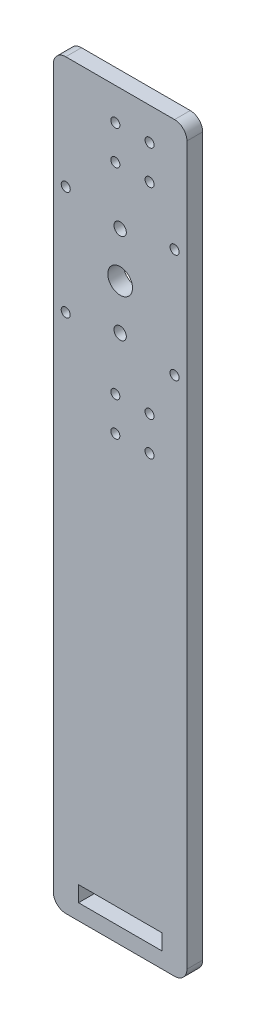
ISO-10303-21;
HEADER;
FILE_DESCRIPTION(('STEP AP214'),'2;1');
FILE_NAME('part.step','',(''),(''),'','','');
FILE_SCHEMA(('AUTOMOTIVE_DESIGN { 1 0 10303 214 1 1 1 1 }'));
ENDSEC;
DATA;
#1=APPLICATION_CONTEXT('core data for automotive mechanical design processes');
#2=APPLICATION_PROTOCOL_DEFINITION('international standard','automotive_design',2000,#1);
#3=PRODUCT_CONTEXT('',#1,'mechanical');
#4=PRODUCT('Part','Part','',(#3));
#5=PRODUCT_RELATED_PRODUCT_CATEGORY('part','',(#4));
#6=PRODUCT_DEFINITION_FORMATION('','',#4);
#7=PRODUCT_DEFINITION_CONTEXT('part definition',#1,'design');
#8=PRODUCT_DEFINITION('design','',#6,#7);
#9=PRODUCT_DEFINITION_SHAPE('','',#8);
#10=(LENGTH_UNIT() NAMED_UNIT(*) SI_UNIT(.MILLI.,.METRE.));
#11=(NAMED_UNIT(*) PLANE_ANGLE_UNIT() SI_UNIT($,.RADIAN.));
#12=(NAMED_UNIT(*) SI_UNIT($,.STERADIAN.) SOLID_ANGLE_UNIT());
#13=UNCERTAINTY_MEASURE_WITH_UNIT(LENGTH_MEASURE(1.E-05),#10,'distance_accuracy_value','');
#14=(GEOMETRIC_REPRESENTATION_CONTEXT(3) GLOBAL_UNCERTAINTY_ASSIGNED_CONTEXT((#13)) GLOBAL_UNIT_ASSIGNED_CONTEXT((#10,
#11,#12)) REPRESENTATION_CONTEXT('',''));
#15=CARTESIAN_POINT('',(0.,0.,0.));
#16=DIRECTION('',(0.,0.,1.));
#17=DIRECTION('',(1.,0.,0.));
#18=AXIS2_PLACEMENT_3D('',#15,#16,#17);
#19=CARTESIAN_POINT('',(-27.,-150.,6.35));
#20=DIRECTION('',(0.,1.,0.));
#21=DIRECTION('',(0.,0.,1.));
#22=AXIS2_PLACEMENT_3D('',#19,#20,#21);
#23=PLANE('',#22);
#24=DIRECTION('',(1.,0.,0.));
#25=VECTOR('',#24,1.);
#26=CARTESIAN_POINT('',(-27.,-150.,0.));
#27=LINE('',#26,#25);
#28=CARTESIAN_POINT('',(-22.,-150.,0.));
#29=VERTEX_POINT('',#28);
#30=CARTESIAN_POINT('',(22.,-150.,0.));
#31=VERTEX_POINT('',#30);
#32=EDGE_CURVE('E236',#29,#31,#27,.T.);
#33=ORIENTED_EDGE('',*,*,#32,.T.);
#34=DIRECTION('',(0.,0.,-1.));
#35=VECTOR('',#34,1.);
#36=CARTESIAN_POINT('',(22.,-150.,6.35));
#37=LINE('',#36,#35);
#38=CARTESIAN_POINT('',(22.,-150.,6.35));
#39=VERTEX_POINT('',#38);
#40=EDGE_CURVE('E278',#31,#39,#37,.F.);
#41=ORIENTED_EDGE('',*,*,#40,.T.);
#42=DIRECTION('',(1.,0.,0.));
#43=VECTOR('',#42,1.);
#44=CARTESIAN_POINT('',(-27.,-150.,6.35));
#45=LINE('',#44,#43);
#46=CARTESIAN_POINT('',(-22.,-150.,6.35));
#47=VERTEX_POINT('',#46);
#48=EDGE_CURVE('E239',#47,#39,#45,.T.);
#49=ORIENTED_EDGE('',*,*,#48,.F.);
#50=DIRECTION('',(0.,0.,-1.));
#51=VECTOR('',#50,1.);
#52=CARTESIAN_POINT('',(-22.,-150.,6.35));
#53=LINE('',#52,#51);
#54=EDGE_CURVE('E275',#47,#29,#53,.T.);
#55=ORIENTED_EDGE('',*,*,#54,.T.);
#56=EDGE_LOOP('',(#33,#41,#49,#55));
#57=FACE_BOUND('',#56,.T.);
#58=ADVANCED_FACE('F32',(#57),#23,.F.);
#59=CARTESIAN_POINT('',(27.,-150.,6.35));
#60=DIRECTION('',(-1.,0.,0.));
#61=DIRECTION('',(0.,0.,1.));
#62=AXIS2_PLACEMENT_3D('',#59,#60,#61);
#63=PLANE('',#62);
#64=DIRECTION('',(0.,1.,0.));
#65=VECTOR('',#64,1.);
#66=CARTESIAN_POINT('',(27.,-150.,6.35));
#67=LINE('',#66,#65);
#68=CARTESIAN_POINT('',(27.,-145.,6.35));
#69=VERTEX_POINT('',#68);
#70=CARTESIAN_POINT('',(27.,145.,6.35));
#71=VERTEX_POINT('',#70);
#72=EDGE_CURVE('E242',#69,#71,#67,.T.);
#73=ORIENTED_EDGE('',*,*,#72,.F.);
#74=DIRECTION('',(0.,0.,-1.));
#75=VECTOR('',#74,1.);
#76=CARTESIAN_POINT('',(27.,-145.,6.35));
#77=LINE('',#76,#75);
#78=CARTESIAN_POINT('',(27.,-145.,0.));
#79=VERTEX_POINT('',#78);
#80=EDGE_CURVE('E264',#69,#79,#77,.T.);
#81=ORIENTED_EDGE('',*,*,#80,.T.);
#82=DIRECTION('',(0.,1.,0.));
#83=VECTOR('',#82,1.);
#84=CARTESIAN_POINT('',(27.,-150.,0.));
#85=LINE('',#84,#83);
#86=CARTESIAN_POINT('',(27.,145.,0.));
#87=VERTEX_POINT('',#86);
#88=EDGE_CURVE('E255',#79,#87,#85,.T.);
#89=ORIENTED_EDGE('',*,*,#88,.T.);
#90=DIRECTION('',(0.,0.,-1.));
#91=VECTOR('',#90,1.);
#92=CARTESIAN_POINT('',(27.,145.,6.35));
#93=LINE('',#92,#91);
#94=EDGE_CURVE('E252',#87,#71,#93,.F.);
#95=ORIENTED_EDGE('',*,*,#94,.T.);
#96=EDGE_LOOP('',(#73,#81,#89,#95));
#97=FACE_BOUND('',#96,.T.);
#98=ADVANCED_FACE('F325',(#97),#63,.F.);
#99=CARTESIAN_POINT('',(-27.,150.,6.35));
#100=DIRECTION('',(0.,-1.,0.));
#101=DIRECTION('',(0.,0.,-1.));
#102=AXIS2_PLACEMENT_3D('',#99,#100,#101);
#103=PLANE('',#102);
#104=DIRECTION('',(-1.,0.,0.));
#105=VECTOR('',#104,1.);
#106=CARTESIAN_POINT('',(-27.,150.,6.35));
#107=LINE('',#106,#105);
#108=CARTESIAN_POINT('',(22.,150.,6.35));
#109=VERTEX_POINT('',#108);
#110=CARTESIAN_POINT('',(-22.,150.,6.35));
#111=VERTEX_POINT('',#110);
#112=EDGE_CURVE('E246',#109,#111,#107,.T.);
#113=ORIENTED_EDGE('',*,*,#112,.F.);
#114=DIRECTION('',(0.,0.,-1.));
#115=VECTOR('',#114,1.);
#116=CARTESIAN_POINT('',(22.,150.,6.35));
#117=LINE('',#116,#115);
#118=CARTESIAN_POINT('',(22.,150.,0.));
#119=VERTEX_POINT('',#118);
#120=EDGE_CURVE('E11',#109,#119,#117,.T.);
#121=ORIENTED_EDGE('',*,*,#120,.T.);
#122=DIRECTION('',(-1.,0.,0.));
#123=VECTOR('',#122,1.);
#124=CARTESIAN_POINT('',(-27.,150.,0.));
#125=LINE('',#124,#123);
#126=CARTESIAN_POINT('',(-22.,150.,0.));
#127=VERTEX_POINT('',#126);
#128=EDGE_CURVE('E258',#119,#127,#125,.T.);
#129=ORIENTED_EDGE('',*,*,#128,.T.);
#130=DIRECTION('',(0.,0.,-1.));
#131=VECTOR('',#130,1.);
#132=CARTESIAN_POINT('',(-22.,150.,6.35));
#133=LINE('',#132,#131);
#134=EDGE_CURVE('E40',#127,#111,#133,.F.);
#135=ORIENTED_EDGE('',*,*,#134,.T.);
#136=EDGE_LOOP('',(#113,#121,#129,#135));
#137=FACE_BOUND('',#136,.T.);
#138=ADVANCED_FACE('F295',(#137),#103,.F.);
#139=CARTESIAN_POINT('',(-27.,-150.,6.35));
#140=DIRECTION('',(1.,0.,0.));
#141=DIRECTION('',(0.,0.,-1.));
#142=AXIS2_PLACEMENT_3D('',#139,#140,#141);
#143=PLANE('',#142);
#144=DIRECTION('',(0.,-1.,0.));
#145=VECTOR('',#144,1.);
#146=CARTESIAN_POINT('',(-27.,-150.,0.));
#147=LINE('',#146,#145);
#148=CARTESIAN_POINT('',(-27.,145.,0.));
#149=VERTEX_POINT('',#148);
#150=CARTESIAN_POINT('',(-27.,-145.,0.));
#151=VERTEX_POINT('',#150);
#152=EDGE_CURVE('E243',#149,#151,#147,.T.);
#153=ORIENTED_EDGE('',*,*,#152,.T.);
#154=DIRECTION('',(0.,0.,-1.));
#155=VECTOR('',#154,1.);
#156=CARTESIAN_POINT('',(-27.,-145.,6.35));
#157=LINE('',#156,#155);
#158=CARTESIAN_POINT('',(-27.,-145.,6.35));
#159=VERTEX_POINT('',#158);
#160=EDGE_CURVE('E291',#151,#159,#157,.F.);
#161=ORIENTED_EDGE('',*,*,#160,.T.);
#162=DIRECTION('',(0.,-1.,0.));
#163=VECTOR('',#162,1.);
#164=CARTESIAN_POINT('',(-27.,-150.,6.35));
#165=LINE('',#164,#163);
#166=CARTESIAN_POINT('',(-27.,145.,6.35));
#167=VERTEX_POINT('',#166);
#168=EDGE_CURVE('E249',#167,#159,#165,.T.);
#169=ORIENTED_EDGE('',*,*,#168,.F.);
#170=DIRECTION('',(0.,0.,-1.));
#171=VECTOR('',#170,1.);
#172=CARTESIAN_POINT('',(-27.,145.,6.35));
#173=LINE('',#172,#171);
#174=EDGE_CURVE('E288',#167,#149,#173,.T.);
#175=ORIENTED_EDGE('',*,*,#174,.T.);
#176=EDGE_LOOP('',(#153,#161,#169,#175));
#177=FACE_BOUND('',#176,.T.);
#178=ADVANCED_FACE('F307',(#177),#143,.F.);
#179=CARTESIAN_POINT('',(0.,0.,6.35));
#180=DIRECTION('',(0.,0.,1.));
#181=DIRECTION('',(1.,0.,0.));
#182=AXIS2_PLACEMENT_3D('',#179,#180,#181);
#183=PLANE('',#182);
#184=CARTESIAN_POINT('',(0.,64.25,6.35));
#185=DIRECTION('',(0.,0.,1.));
#186=DIRECTION('',(1.,0.,0.));
#187=AXIS2_PLACEMENT_3D('',#184,#185,#186);
#188=CIRCLE('',#187,2.48919999999999);
#189=CARTESIAN_POINT('',(2.48919999999999,64.25,6.35));
#190=VERTEX_POINT('',#189);
#191=EDGE_CURVE('E656',#190,#190,#188,.T.);
#192=ORIENTED_EDGE('',*,*,#191,.F.);
#193=EDGE_LOOP('',(#192));
#194=FACE_BOUND('',#193,.T.);
#195=CARTESIAN_POINT('',(0.,100.75,6.35));
#196=DIRECTION('',(0.,0.,1.));
#197=DIRECTION('',(1.,0.,0.));
#198=AXIS2_PLACEMENT_3D('',#195,#196,#197);
#199=CIRCLE('',#198,2.48919999999999);
#200=CARTESIAN_POINT('',(2.48919999999998,100.75,6.35));
#201=VERTEX_POINT('',#200);
#202=EDGE_CURVE('E658',#201,#201,#199,.T.);
#203=ORIENTED_EDGE('',*,*,#202,.F.);
#204=EDGE_LOOP('',(#203));
#205=FACE_BOUND('',#204,.T.);
#206=DIRECTION('',(-1.,0.,0.));
#207=VECTOR('',#206,1.);
#208=CARTESIAN_POINT('',(-16.8250000000001,-137.3,6.35));
#209=LINE('',#208,#207);
#210=CARTESIAN_POINT('',(16.8249999999999,-137.3,6.35));
#211=VERTEX_POINT('',#210);
#212=CARTESIAN_POINT('',(-16.8250000000001,-137.3,6.35));
#213=VERTEX_POINT('',#212);
#214=EDGE_CURVE('E47',#211,#213,#209,.T.);
#215=ORIENTED_EDGE('',*,*,#214,.F.);
#216=DIRECTION('',(0.,1.,0.));
#217=VECTOR('',#216,1.);
#218=CARTESIAN_POINT('',(16.8249999999999,-137.3,6.35));
#219=LINE('',#218,#217);
#220=CARTESIAN_POINT('',(16.8249999999999,-143.65,6.35));
#221=VERTEX_POINT('',#220);
#222=EDGE_CURVE('E139',#221,#211,#219,.T.);
#223=ORIENTED_EDGE('',*,*,#222,.F.);
#224=DIRECTION('',(1.,0.,0.));
#225=VECTOR('',#224,1.);
#226=CARTESIAN_POINT('',(-16.8250000000001,-143.65,6.35));
#227=LINE('',#226,#225);
#228=CARTESIAN_POINT('',(-16.8250000000001,-143.65,6.35));
#229=VERTEX_POINT('',#228);
#230=EDGE_CURVE('E142',#229,#221,#227,.T.);
#231=ORIENTED_EDGE('',*,*,#230,.F.);
#232=DIRECTION('',(0.,-1.,0.));
#233=VECTOR('',#232,1.);
#234=CARTESIAN_POINT('',(-16.8250000000001,-137.3,6.35));
#235=LINE('',#234,#233);
#236=EDGE_CURVE('E151',#213,#229,#235,.T.);
#237=ORIENTED_EDGE('',*,*,#236,.F.);
#238=EDGE_LOOP('',(#215,#223,#231,#237));
#239=FACE_BOUND('',#238,.T.);
#240=CARTESIAN_POINT('',(-22.,104.5,6.35));
#241=DIRECTION('',(0.,0.,1.));
#242=DIRECTION('',(1.,0.,0.));
#243=AXIS2_PLACEMENT_3D('',#240,#241,#242);
#244=CIRCLE('',#243,1.8288);
#245=CARTESIAN_POINT('',(-20.1712,104.5,6.35));
#246=VERTEX_POINT('',#245);
#247=EDGE_CURVE('E157',#246,#246,#244,.T.);
#248=ORIENTED_EDGE('',*,*,#247,.F.);
#249=EDGE_LOOP('',(#248));
#250=FACE_BOUND('',#249,.T.);
#251=CARTESIAN_POINT('',(-22.,60.5,6.35));
#252=DIRECTION('',(0.,0.,1.));
#253=DIRECTION('',(1.,0.,0.));
#254=AXIS2_PLACEMENT_3D('',#251,#252,#253);
#255=CIRCLE('',#254,1.8288);
#256=CARTESIAN_POINT('',(-20.1712,60.5,6.35));
#257=VERTEX_POINT('',#256);
#258=EDGE_CURVE('E166',#257,#257,#255,.T.);
#259=ORIENTED_EDGE('',*,*,#258,.F.);
#260=EDGE_LOOP('',(#259));
#261=FACE_BOUND('',#260,.T.);
#262=CARTESIAN_POINT('',(22.,60.5,6.35));
#263=DIRECTION('',(0.,0.,1.));
#264=DIRECTION('',(1.,0.,0.));
#265=AXIS2_PLACEMENT_3D('',#262,#263,#264);
#266=CIRCLE('',#265,1.8288);
#267=CARTESIAN_POINT('',(23.8288,60.5,6.35));
#268=VERTEX_POINT('',#267);
#269=EDGE_CURVE('E172',#268,#268,#266,.T.);
#270=ORIENTED_EDGE('',*,*,#269,.F.);
#271=EDGE_LOOP('',(#270));
#272=FACE_BOUND('',#271,.T.);
#273=CARTESIAN_POINT('',(22.,104.5,6.35));
#274=DIRECTION('',(0.,0.,1.));
#275=DIRECTION('',(1.,0.,0.));
#276=AXIS2_PLACEMENT_3D('',#273,#274,#275);
#277=CIRCLE('',#276,1.8288);
#278=CARTESIAN_POINT('',(23.8288,104.5,6.35));
#279=VERTEX_POINT('',#278);
#280=EDGE_CURVE('E178',#279,#279,#277,.T.);
#281=ORIENTED_EDGE('',*,*,#280,.F.);
#282=EDGE_LOOP('',(#281));
#283=FACE_BOUND('',#282,.T.);
#284=CARTESIAN_POINT('',(-1.94479721322324,123.085202786777,6.35));
#285=DIRECTION('',(0.,0.,1.));
#286=DIRECTION('',(1.,0.,0.));
#287=AXIS2_PLACEMENT_3D('',#284,#285,#286);
#288=CIRCLE('',#287,1.8288);
#289=CARTESIAN_POINT('',(-0.115997213223238,123.085202786777,6.35));
#290=VERTEX_POINT('',#289);
#291=EDGE_CURVE('E184',#290,#290,#288,.T.);
#292=ORIENTED_EDGE('',*,*,#291,.F.);
#293=EDGE_LOOP('',(#292));
#294=FACE_BOUND('',#293,.T.);
#295=CARTESIAN_POINT('',(-1.94479721322324,136.914797213223,6.35));
#296=DIRECTION('',(0.,0.,1.));
#297=DIRECTION('',(1.,0.,0.));
#298=AXIS2_PLACEMENT_3D('',#295,#296,#297);
#299=CIRCLE('',#298,1.8288);
#300=CARTESIAN_POINT('',(-0.115997213223238,136.914797213223,6.35));
#301=VERTEX_POINT('',#300);
#302=EDGE_CURVE('E190',#301,#301,#299,.T.);
#303=ORIENTED_EDGE('',*,*,#302,.F.);
#304=EDGE_LOOP('',(#303));
#305=FACE_BOUND('',#304,.T.);
#306=CARTESIAN_POINT('',(11.8847972132232,136.914797213223,6.35));
#307=DIRECTION('',(0.,0.,1.));
#308=DIRECTION('',(1.,0.,0.));
#309=AXIS2_PLACEMENT_3D('',#306,#307,#308);
#310=CIRCLE('',#309,1.8288);
#311=CARTESIAN_POINT('',(13.7135972132232,136.914797213223,6.35));
#312=VERTEX_POINT('',#311);
#313=EDGE_CURVE('E196',#312,#312,#310,.T.);
#314=ORIENTED_EDGE('',*,*,#313,.F.);
#315=EDGE_LOOP('',(#314));
#316=FACE_BOUND('',#315,.T.);
#317=CARTESIAN_POINT('',(11.8847972132232,123.085202786777,6.35));
#318=DIRECTION('',(0.,0.,1.));
#319=DIRECTION('',(1.,0.,0.));
#320=AXIS2_PLACEMENT_3D('',#317,#318,#319);
#321=CIRCLE('',#320,1.8288);
#322=CARTESIAN_POINT('',(13.7135972132232,123.085202786777,6.35));
#323=VERTEX_POINT('',#322);
#324=EDGE_CURVE('E202',#323,#323,#321,.T.);
#325=ORIENTED_EDGE('',*,*,#324,.F.);
#326=EDGE_LOOP('',(#325));
#327=FACE_BOUND('',#326,.T.);
#328=CARTESIAN_POINT('',(-1.94479721322324,41.9147972132232,6.35));
#329=DIRECTION('',(0.,0.,1.));
#330=DIRECTION('',(1.,0.,0.));
#331=AXIS2_PLACEMENT_3D('',#328,#329,#330);
#332=CIRCLE('',#331,1.8288);
#333=CARTESIAN_POINT('',(-0.11599721322324,41.9147972132232,6.35));
#334=VERTEX_POINT('',#333);
#335=EDGE_CURVE('E208',#334,#334,#332,.T.);
#336=ORIENTED_EDGE('',*,*,#335,.F.);
#337=EDGE_LOOP('',(#336));
#338=FACE_BOUND('',#337,.T.);
#339=CARTESIAN_POINT('',(11.8847972132233,41.9147972132232,6.35));
#340=DIRECTION('',(0.,0.,1.));
#341=DIRECTION('',(1.,0.,0.));
#342=AXIS2_PLACEMENT_3D('',#339,#340,#341);
#343=CIRCLE('',#342,1.8288);
#344=CARTESIAN_POINT('',(13.7135972132233,41.9147972132232,6.35));
#345=VERTEX_POINT('',#344);
#346=EDGE_CURVE('E214',#345,#345,#343,.T.);
#347=ORIENTED_EDGE('',*,*,#346,.F.);
#348=EDGE_LOOP('',(#347));
#349=FACE_BOUND('',#348,.T.);
#350=CARTESIAN_POINT('',(11.8847972132233,28.0852027867768,6.35));
#351=DIRECTION('',(0.,0.,1.));
#352=DIRECTION('',(1.,0.,0.));
#353=AXIS2_PLACEMENT_3D('',#350,#351,#352);
#354=CIRCLE('',#353,1.8288);
#355=CARTESIAN_POINT('',(13.7135972132233,28.0852027867768,6.35));
#356=VERTEX_POINT('',#355);
#357=EDGE_CURVE('E220',#356,#356,#354,.T.);
#358=ORIENTED_EDGE('',*,*,#357,.F.);
#359=EDGE_LOOP('',(#358));
#360=FACE_BOUND('',#359,.T.);
#361=CARTESIAN_POINT('',(-1.94479721322324,28.0852027867768,6.35));
#362=DIRECTION('',(0.,0.,1.));
#363=DIRECTION('',(1.,0.,0.));
#364=AXIS2_PLACEMENT_3D('',#361,#362,#363);
#365=CIRCLE('',#364,1.8288);
#366=CARTESIAN_POINT('',(-0.11599721322324,28.0852027867768,6.35));
#367=VERTEX_POINT('',#366);
#368=EDGE_CURVE('E226',#367,#367,#365,.T.);
#369=ORIENTED_EDGE('',*,*,#368,.F.);
#370=EDGE_LOOP('',(#369));
#371=FACE_BOUND('',#370,.T.);
#372=CARTESIAN_POINT('',(0.,82.5,6.35));
#373=DIRECTION('',(0.,0.,1.));
#374=DIRECTION('',(1.,0.,0.));
#375=AXIS2_PLACEMENT_3D('',#372,#373,#374);
#376=CIRCLE('',#375,5.);
#377=CARTESIAN_POINT('',(4.99999999999999,82.5,6.35));
#378=VERTEX_POINT('',#377);
#379=EDGE_CURVE('E232',#378,#378,#376,.T.);
#380=ORIENTED_EDGE('',*,*,#379,.F.);
#381=EDGE_LOOP('',(#380));
#382=FACE_BOUND('',#381,.T.);
#383=ORIENTED_EDGE('',*,*,#48,.T.);
#384=CARTESIAN_POINT('',(22.,-145.,6.35));
#385=DIRECTION('',(0.,0.,1.));
#386=DIRECTION('',(1.,0.,0.));
#387=AXIS2_PLACEMENT_3D('',#384,#385,#386);
#388=CIRCLE('',#387,5.);
#389=EDGE_CURVE('E286',#39,#69,#388,.T.);
#390=ORIENTED_EDGE('',*,*,#389,.T.);
#391=ORIENTED_EDGE('',*,*,#72,.T.);
#392=CARTESIAN_POINT('',(22.,145.,6.35));
#393=DIRECTION('',(0.,0.,1.));
#394=DIRECTION('',(1.,0.,0.));
#395=AXIS2_PLACEMENT_3D('',#392,#393,#394);
#396=CIRCLE('',#395,5.);
#397=EDGE_CURVE('E282',#71,#109,#396,.T.);
#398=ORIENTED_EDGE('',*,*,#397,.T.);
#399=ORIENTED_EDGE('',*,*,#112,.T.);
#400=CARTESIAN_POINT('',(-22.,145.,6.35));
#401=DIRECTION('',(0.,0.,1.));
#402=DIRECTION('',(1.,0.,0.));
#403=AXIS2_PLACEMENT_3D('',#400,#401,#402);
#404=CIRCLE('',#403,5.);
#405=EDGE_CURVE('E280',#111,#167,#404,.T.);
#406=ORIENTED_EDGE('',*,*,#405,.T.);
#407=ORIENTED_EDGE('',*,*,#168,.T.);
#408=CARTESIAN_POINT('',(-22.,-145.,6.35));
#409=DIRECTION('',(0.,0.,1.));
#410=DIRECTION('',(1.,0.,0.));
#411=AXIS2_PLACEMENT_3D('',#408,#409,#410);
#412=CIRCLE('',#411,5.);
#413=EDGE_CURVE('E284',#159,#47,#412,.T.);
#414=ORIENTED_EDGE('',*,*,#413,.T.);
#415=EDGE_LOOP('',(#383,#390,#391,#398,#399,#406,#407,#414));
#416=FACE_BOUND('',#415,.T.);
#417=ADVANCED_FACE('F301',(#194,#205,#239,#250,#261,#272,#283,#294,#305,#316,#327,#338,#349,
#360,#371,#382,#416),#183,.T.);
#418=CARTESIAN_POINT('',(0.,0.,0.));
#419=DIRECTION('',(0.,0.,1.));
#420=DIRECTION('',(1.,0.,0.));
#421=AXIS2_PLACEMENT_3D('',#418,#419,#420);
#422=PLANE('',#421);
#423=CARTESIAN_POINT('',(0.,64.25,0.));
#424=DIRECTION('',(0.,0.,1.));
#425=DIRECTION('',(1.,0.,0.));
#426=AXIS2_PLACEMENT_3D('',#423,#424,#425);
#427=CIRCLE('',#426,2.48919999999999);
#428=CARTESIAN_POINT('',(2.48919999999999,64.25,0.));
#429=VERTEX_POINT('',#428);
#430=EDGE_CURVE('E653',#429,#429,#427,.T.);
#431=ORIENTED_EDGE('',*,*,#430,.T.);
#432=EDGE_LOOP('',(#431));
#433=FACE_BOUND('',#432,.T.);
#434=CARTESIAN_POINT('',(0.,100.75,0.));
#435=DIRECTION('',(0.,0.,1.));
#436=DIRECTION('',(1.,0.,0.));
#437=AXIS2_PLACEMENT_3D('',#434,#435,#436);
#438=CIRCLE('',#437,2.48919999999999);
#439=CARTESIAN_POINT('',(2.48919999999998,100.75,0.));
#440=VERTEX_POINT('',#439);
#441=EDGE_CURVE('E145',#440,#440,#438,.T.);
#442=ORIENTED_EDGE('',*,*,#441,.T.);
#443=EDGE_LOOP('',(#442));
#444=FACE_BOUND('',#443,.T.);
#445=DIRECTION('',(0.,1.,0.));
#446=VECTOR('',#445,1.);
#447=CARTESIAN_POINT('',(16.8249999999999,-137.3,0.));
#448=LINE('',#447,#446);
#449=CARTESIAN_POINT('',(16.8249999999999,-143.65,0.));
#450=VERTEX_POINT('',#449);
#451=CARTESIAN_POINT('',(16.8249999999999,-137.3,0.));
#452=VERTEX_POINT('',#451);
#453=EDGE_CURVE('E129',#450,#452,#448,.T.);
#454=ORIENTED_EDGE('',*,*,#453,.T.);
#455=DIRECTION('',(-1.,0.,0.));
#456=VECTOR('',#455,1.);
#457=CARTESIAN_POINT('',(-16.8250000000001,-137.3,0.));
#458=LINE('',#457,#456);
#459=CARTESIAN_POINT('',(-16.8250000000001,-137.3,0.));
#460=VERTEX_POINT('',#459);
#461=EDGE_CURVE('E123',#452,#460,#458,.T.);
#462=ORIENTED_EDGE('',*,*,#461,.T.);
#463=DIRECTION('',(0.,-1.,0.));
#464=VECTOR('',#463,1.);
#465=CARTESIAN_POINT('',(-16.8250000000001,-137.3,0.));
#466=LINE('',#465,#464);
#467=CARTESIAN_POINT('',(-16.8250000000001,-143.65,0.));
#468=VERTEX_POINT('',#467);
#469=EDGE_CURVE('E132',#460,#468,#466,.T.);
#470=ORIENTED_EDGE('',*,*,#469,.T.);
#471=DIRECTION('',(1.,0.,0.));
#472=VECTOR('',#471,1.);
#473=CARTESIAN_POINT('',(-16.8250000000001,-143.65,0.));
#474=LINE('',#473,#472);
#475=EDGE_CURVE('E55',#468,#450,#474,.T.);
#476=ORIENTED_EDGE('',*,*,#475,.T.);
#477=EDGE_LOOP('',(#454,#462,#470,#476));
#478=FACE_BOUND('',#477,.T.);
#479=CARTESIAN_POINT('',(-22.,104.5,0.));
#480=DIRECTION('',(0.,0.,1.));
#481=DIRECTION('',(1.,0.,0.));
#482=AXIS2_PLACEMENT_3D('',#479,#480,#481);
#483=CIRCLE('',#482,1.8288);
#484=CARTESIAN_POINT('',(-20.1712,104.5,0.));
#485=VERTEX_POINT('',#484);
#486=EDGE_CURVE('E163',#485,#485,#483,.T.);
#487=ORIENTED_EDGE('',*,*,#486,.T.);
#488=EDGE_LOOP('',(#487));
#489=FACE_BOUND('',#488,.T.);
#490=CARTESIAN_POINT('',(-22.,60.5,0.));
#491=DIRECTION('',(0.,0.,1.));
#492=DIRECTION('',(1.,0.,0.));
#493=AXIS2_PLACEMENT_3D('',#490,#491,#492);
#494=CIRCLE('',#493,1.8288);
#495=CARTESIAN_POINT('',(-20.1712,60.5,0.));
#496=VERTEX_POINT('',#495);
#497=EDGE_CURVE('E169',#496,#496,#494,.T.);
#498=ORIENTED_EDGE('',*,*,#497,.T.);
#499=EDGE_LOOP('',(#498));
#500=FACE_BOUND('',#499,.T.);
#501=CARTESIAN_POINT('',(22.,60.5,0.));
#502=DIRECTION('',(0.,0.,1.));
#503=DIRECTION('',(1.,0.,0.));
#504=AXIS2_PLACEMENT_3D('',#501,#502,#503);
#505=CIRCLE('',#504,1.8288);
#506=CARTESIAN_POINT('',(23.8288,60.5,0.));
#507=VERTEX_POINT('',#506);
#508=EDGE_CURVE('E175',#507,#507,#505,.T.);
#509=ORIENTED_EDGE('',*,*,#508,.T.);
#510=EDGE_LOOP('',(#509));
#511=FACE_BOUND('',#510,.T.);
#512=CARTESIAN_POINT('',(22.,104.5,0.));
#513=DIRECTION('',(0.,0.,1.));
#514=DIRECTION('',(1.,0.,0.));
#515=AXIS2_PLACEMENT_3D('',#512,#513,#514);
#516=CIRCLE('',#515,1.8288);
#517=CARTESIAN_POINT('',(23.8288,104.5,0.));
#518=VERTEX_POINT('',#517);
#519=EDGE_CURVE('E181',#518,#518,#516,.T.);
#520=ORIENTED_EDGE('',*,*,#519,.T.);
#521=EDGE_LOOP('',(#520));
#522=FACE_BOUND('',#521,.T.);
#523=CARTESIAN_POINT('',(-1.94479721322324,123.085202786777,0.));
#524=DIRECTION('',(0.,0.,1.));
#525=DIRECTION('',(1.,0.,0.));
#526=AXIS2_PLACEMENT_3D('',#523,#524,#525);
#527=CIRCLE('',#526,1.8288);
#528=CARTESIAN_POINT('',(-0.115997213223239,123.085202786777,0.));
#529=VERTEX_POINT('',#528);
#530=EDGE_CURVE('E187',#529,#529,#527,.T.);
#531=ORIENTED_EDGE('',*,*,#530,.T.);
#532=EDGE_LOOP('',(#531));
#533=FACE_BOUND('',#532,.T.);
#534=CARTESIAN_POINT('',(-1.94479721322324,136.914797213223,0.));
#535=DIRECTION('',(0.,0.,1.));
#536=DIRECTION('',(1.,0.,0.));
#537=AXIS2_PLACEMENT_3D('',#534,#535,#536);
#538=CIRCLE('',#537,1.8288);
#539=CARTESIAN_POINT('',(-0.115997213223239,136.914797213223,0.));
#540=VERTEX_POINT('',#539);
#541=EDGE_CURVE('E193',#540,#540,#538,.T.);
#542=ORIENTED_EDGE('',*,*,#541,.T.);
#543=EDGE_LOOP('',(#542));
#544=FACE_BOUND('',#543,.T.);
#545=CARTESIAN_POINT('',(11.8847972132232,136.914797213223,0.));
#546=DIRECTION('',(0.,0.,1.));
#547=DIRECTION('',(1.,0.,0.));
#548=AXIS2_PLACEMENT_3D('',#545,#546,#547);
#549=CIRCLE('',#548,1.8288);
#550=CARTESIAN_POINT('',(13.7135972132232,136.914797213223,0.));
#551=VERTEX_POINT('',#550);
#552=EDGE_CURVE('E199',#551,#551,#549,.T.);
#553=ORIENTED_EDGE('',*,*,#552,.T.);
#554=EDGE_LOOP('',(#553));
#555=FACE_BOUND('',#554,.T.);
#556=CARTESIAN_POINT('',(11.8847972132232,123.085202786777,0.));
#557=DIRECTION('',(0.,0.,1.));
#558=DIRECTION('',(1.,0.,0.));
#559=AXIS2_PLACEMENT_3D('',#556,#557,#558);
#560=CIRCLE('',#559,1.8288);
#561=CARTESIAN_POINT('',(13.7135972132232,123.085202786777,0.));
#562=VERTEX_POINT('',#561);
#563=EDGE_CURVE('E205',#562,#562,#560,.T.);
#564=ORIENTED_EDGE('',*,*,#563,.T.);
#565=EDGE_LOOP('',(#564));
#566=FACE_BOUND('',#565,.T.);
#567=CARTESIAN_POINT('',(-1.94479721322324,41.9147972132232,0.));
#568=DIRECTION('',(0.,0.,1.));
#569=DIRECTION('',(1.,0.,0.));
#570=AXIS2_PLACEMENT_3D('',#567,#568,#569);
#571=CIRCLE('',#570,1.8288);
#572=CARTESIAN_POINT('',(-0.115997213223241,41.9147972132232,0.));
#573=VERTEX_POINT('',#572);
#574=EDGE_CURVE('E211',#573,#573,#571,.T.);
#575=ORIENTED_EDGE('',*,*,#574,.T.);
#576=EDGE_LOOP('',(#575));
#577=FACE_BOUND('',#576,.T.);
#578=CARTESIAN_POINT('',(11.8847972132233,41.9147972132232,0.));
#579=DIRECTION('',(0.,0.,1.));
#580=DIRECTION('',(1.,0.,0.));
#581=AXIS2_PLACEMENT_3D('',#578,#579,#580);
#582=CIRCLE('',#581,1.8288);
#583=CARTESIAN_POINT('',(13.7135972132233,41.9147972132232,0.));
#584=VERTEX_POINT('',#583);
#585=EDGE_CURVE('E217',#584,#584,#582,.T.);
#586=ORIENTED_EDGE('',*,*,#585,.T.);
#587=EDGE_LOOP('',(#586));
#588=FACE_BOUND('',#587,.T.);
#589=CARTESIAN_POINT('',(11.8847972132233,28.0852027867768,0.));
#590=DIRECTION('',(0.,0.,1.));
#591=DIRECTION('',(1.,0.,0.));
#592=AXIS2_PLACEMENT_3D('',#589,#590,#591);
#593=CIRCLE('',#592,1.8288);
#594=CARTESIAN_POINT('',(13.7135972132233,28.0852027867768,0.));
#595=VERTEX_POINT('',#594);
#596=EDGE_CURVE('E223',#595,#595,#593,.T.);
#597=ORIENTED_EDGE('',*,*,#596,.T.);
#598=EDGE_LOOP('',(#597));
#599=FACE_BOUND('',#598,.T.);
#600=CARTESIAN_POINT('',(-1.94479721322324,28.0852027867768,0.));
#601=DIRECTION('',(0.,0.,1.));
#602=DIRECTION('',(1.,0.,0.));
#603=AXIS2_PLACEMENT_3D('',#600,#601,#602);
#604=CIRCLE('',#603,1.8288);
#605=CARTESIAN_POINT('',(-0.115997213223241,28.0852027867768,0.));
#606=VERTEX_POINT('',#605);
#607=EDGE_CURVE('E229',#606,#606,#604,.T.);
#608=ORIENTED_EDGE('',*,*,#607,.T.);
#609=EDGE_LOOP('',(#608));
#610=FACE_BOUND('',#609,.T.);
#611=CARTESIAN_POINT('',(0.,82.5,0.));
#612=DIRECTION('',(0.,0.,1.));
#613=DIRECTION('',(1.,0.,0.));
#614=AXIS2_PLACEMENT_3D('',#611,#612,#613);
#615=CIRCLE('',#614,5.);
#616=CARTESIAN_POINT('',(4.99999999999999,82.5,0.));
#617=VERTEX_POINT('',#616);
#618=EDGE_CURVE('E233',#617,#617,#615,.T.);
#619=ORIENTED_EDGE('',*,*,#618,.T.);
#620=EDGE_LOOP('',(#619));
#621=FACE_BOUND('',#620,.T.);
#622=ORIENTED_EDGE('',*,*,#88,.F.);
#623=CARTESIAN_POINT('',(22.,-145.,0.));
#624=DIRECTION('',(0.,0.,1.));
#625=DIRECTION('',(1.,0.,0.));
#626=AXIS2_PLACEMENT_3D('',#623,#624,#625);
#627=CIRCLE('',#626,5.);
#628=EDGE_CURVE('E273',#79,#31,#627,.F.);
#629=ORIENTED_EDGE('',*,*,#628,.T.);
#630=ORIENTED_EDGE('',*,*,#32,.F.);
#631=CARTESIAN_POINT('',(-22.,-145.,0.));
#632=DIRECTION('',(0.,0.,1.));
#633=DIRECTION('',(1.,0.,0.));
#634=AXIS2_PLACEMENT_3D('',#631,#632,#633);
#635=CIRCLE('',#634,5.);
#636=EDGE_CURVE('E271',#29,#151,#635,.F.);
#637=ORIENTED_EDGE('',*,*,#636,.T.);
#638=ORIENTED_EDGE('',*,*,#152,.F.);
#639=CARTESIAN_POINT('',(-22.,145.,0.));
#640=DIRECTION('',(0.,0.,1.));
#641=DIRECTION('',(1.,0.,0.));
#642=AXIS2_PLACEMENT_3D('',#639,#640,#641);
#643=CIRCLE('',#642,5.);
#644=EDGE_CURVE('E267',#149,#127,#643,.F.);
#645=ORIENTED_EDGE('',*,*,#644,.T.);
#646=ORIENTED_EDGE('',*,*,#128,.F.);
#647=CARTESIAN_POINT('',(22.,145.,0.));
#648=DIRECTION('',(0.,0.,1.));
#649=DIRECTION('',(1.,0.,0.));
#650=AXIS2_PLACEMENT_3D('',#647,#648,#649);
#651=CIRCLE('',#650,5.);
#652=EDGE_CURVE('E269',#119,#87,#651,.F.);
#653=ORIENTED_EDGE('',*,*,#652,.T.);
#654=EDGE_LOOP('',(#622,#629,#630,#637,#638,#645,#646,#653));
#655=FACE_BOUND('',#654,.T.);
#656=ADVANCED_FACE('F136',(#433,#444,#478,#489,#500,#511,#522,#533,#544,#555,#566,#577,#588,
#599,#610,#621,#655),#422,.F.);
#657=CARTESIAN_POINT('',(22.,-145.,6.35));
#658=DIRECTION('',(0.,0.,-1.));
#659=DIRECTION('',(-1.,0.,0.));
#660=AXIS2_PLACEMENT_3D('',#657,#658,#659);
#661=CYLINDRICAL_SURFACE('',#660,5.);
#662=ORIENTED_EDGE('',*,*,#389,.F.);
#663=ORIENTED_EDGE('',*,*,#40,.F.);
#664=ORIENTED_EDGE('',*,*,#628,.F.);
#665=ORIENTED_EDGE('',*,*,#80,.F.);
#666=EDGE_LOOP('',(#662,#663,#664,#665));
#667=FACE_BOUND('',#666,.T.);
#668=ADVANCED_FACE('F323',(#667),#661,.T.);
#669=CARTESIAN_POINT('',(-22.,-145.,6.35));
#670=DIRECTION('',(0.,0.,-1.));
#671=DIRECTION('',(-1.,0.,0.));
#672=AXIS2_PLACEMENT_3D('',#669,#670,#671);
#673=CYLINDRICAL_SURFACE('',#672,5.);
#674=ORIENTED_EDGE('',*,*,#413,.F.);
#675=ORIENTED_EDGE('',*,*,#160,.F.);
#676=ORIENTED_EDGE('',*,*,#636,.F.);
#677=ORIENTED_EDGE('',*,*,#54,.F.);
#678=EDGE_LOOP('',(#674,#675,#676,#677));
#679=FACE_BOUND('',#678,.T.);
#680=ADVANCED_FACE('F315',(#679),#673,.T.);
#681=CARTESIAN_POINT('',(22.,145.,6.35));
#682=DIRECTION('',(0.,0.,-1.));
#683=DIRECTION('',(-1.,0.,0.));
#684=AXIS2_PLACEMENT_3D('',#681,#682,#683);
#685=CYLINDRICAL_SURFACE('',#684,5.);
#686=ORIENTED_EDGE('',*,*,#397,.F.);
#687=ORIENTED_EDGE('',*,*,#94,.F.);
#688=ORIENTED_EDGE('',*,*,#652,.F.);
#689=ORIENTED_EDGE('',*,*,#120,.F.);
#690=EDGE_LOOP('',(#686,#687,#688,#689));
#691=FACE_BOUND('',#690,.T.);
#692=ADVANCED_FACE('F328',(#691),#685,.T.);
#693=CARTESIAN_POINT('',(-22.,145.,6.35));
#694=DIRECTION('',(0.,0.,-1.));
#695=DIRECTION('',(-1.,0.,0.));
#696=AXIS2_PLACEMENT_3D('',#693,#694,#695);
#697=CYLINDRICAL_SURFACE('',#696,5.);
#698=ORIENTED_EDGE('',*,*,#405,.F.);
#699=ORIENTED_EDGE('',*,*,#134,.F.);
#700=ORIENTED_EDGE('',*,*,#644,.F.);
#701=ORIENTED_EDGE('',*,*,#174,.F.);
#702=EDGE_LOOP('',(#698,#699,#700,#701));
#703=FACE_BOUND('',#702,.T.);
#704=ADVANCED_FACE('F34',(#703),#697,.T.);
#705=CARTESIAN_POINT('',(0.,82.5,0.));
#706=DIRECTION('',(0.,0.,1.));
#707=DIRECTION('',(1.,0.,0.));
#708=AXIS2_PLACEMENT_3D('',#705,#706,#707);
#709=CYLINDRICAL_SURFACE('',#708,5.);
#710=ORIENTED_EDGE('',*,*,#618,.F.);
#711=EDGE_LOOP('',(#710));
#712=FACE_BOUND('',#711,.T.);
#713=ORIENTED_EDGE('',*,*,#379,.T.);
#714=EDGE_LOOP('',(#713));
#715=FACE_BOUND('',#714,.T.);
#716=ADVANCED_FACE('F334',(#712,#715),#709,.F.);
#717=CARTESIAN_POINT('',(-1.94479721322324,28.0852027867768,6.35));
#718=DIRECTION('',(0.,0.,1.));
#719=DIRECTION('',(1.,0.,0.));
#720=AXIS2_PLACEMENT_3D('',#717,#718,#719);
#721=CYLINDRICAL_SURFACE('',#720,1.8288);
#722=ORIENTED_EDGE('',*,*,#607,.F.);
#723=EDGE_LOOP('',(#722));
#724=FACE_BOUND('',#723,.T.);
#725=ORIENTED_EDGE('',*,*,#368,.T.);
#726=EDGE_LOOP('',(#725));
#727=FACE_BOUND('',#726,.T.);
#728=ADVANCED_FACE('F463',(#724,#727),#721,.F.);
#729=CARTESIAN_POINT('',(11.8847972132233,28.0852027867768,6.35));
#730=DIRECTION('',(0.,0.,1.));
#731=DIRECTION('',(1.,0.,0.));
#732=AXIS2_PLACEMENT_3D('',#729,#730,#731);
#733=CYLINDRICAL_SURFACE('',#732,1.8288);
#734=ORIENTED_EDGE('',*,*,#596,.F.);
#735=EDGE_LOOP('',(#734));
#736=FACE_BOUND('',#735,.T.);
#737=ORIENTED_EDGE('',*,*,#357,.T.);
#738=EDGE_LOOP('',(#737));
#739=FACE_BOUND('',#738,.T.);
#740=ADVANCED_FACE('F459',(#736,#739),#733,.F.);
#741=CARTESIAN_POINT('',(11.8847972132233,41.9147972132232,6.35));
#742=DIRECTION('',(0.,0.,1.));
#743=DIRECTION('',(1.,0.,0.));
#744=AXIS2_PLACEMENT_3D('',#741,#742,#743);
#745=CYLINDRICAL_SURFACE('',#744,1.8288);
#746=ORIENTED_EDGE('',*,*,#585,.F.);
#747=EDGE_LOOP('',(#746));
#748=FACE_BOUND('',#747,.T.);
#749=ORIENTED_EDGE('',*,*,#346,.T.);
#750=EDGE_LOOP('',(#749));
#751=FACE_BOUND('',#750,.T.);
#752=ADVANCED_FACE('F455',(#748,#751),#745,.F.);
#753=CARTESIAN_POINT('',(-1.94479721322324,41.9147972132232,6.35));
#754=DIRECTION('',(0.,0.,1.));
#755=DIRECTION('',(1.,0.,0.));
#756=AXIS2_PLACEMENT_3D('',#753,#754,#755);
#757=CYLINDRICAL_SURFACE('',#756,1.8288);
#758=ORIENTED_EDGE('',*,*,#574,.F.);
#759=EDGE_LOOP('',(#758));
#760=FACE_BOUND('',#759,.T.);
#761=ORIENTED_EDGE('',*,*,#335,.T.);
#762=EDGE_LOOP('',(#761));
#763=FACE_BOUND('',#762,.T.);
#764=ADVANCED_FACE('F451',(#760,#763),#757,.F.);
#765=CARTESIAN_POINT('',(11.8847972132232,123.085202786777,6.35));
#766=DIRECTION('',(0.,0.,1.));
#767=DIRECTION('',(1.,0.,0.));
#768=AXIS2_PLACEMENT_3D('',#765,#766,#767);
#769=CYLINDRICAL_SURFACE('',#768,1.8288);
#770=ORIENTED_EDGE('',*,*,#563,.F.);
#771=EDGE_LOOP('',(#770));
#772=FACE_BOUND('',#771,.T.);
#773=ORIENTED_EDGE('',*,*,#324,.T.);
#774=EDGE_LOOP('',(#773));
#775=FACE_BOUND('',#774,.T.);
#776=ADVANCED_FACE('F447',(#772,#775),#769,.F.);
#777=CARTESIAN_POINT('',(11.8847972132232,136.914797213223,6.35));
#778=DIRECTION('',(0.,0.,1.));
#779=DIRECTION('',(1.,0.,0.));
#780=AXIS2_PLACEMENT_3D('',#777,#778,#779);
#781=CYLINDRICAL_SURFACE('',#780,1.8288);
#782=ORIENTED_EDGE('',*,*,#552,.F.);
#783=EDGE_LOOP('',(#782));
#784=FACE_BOUND('',#783,.T.);
#785=ORIENTED_EDGE('',*,*,#313,.T.);
#786=EDGE_LOOP('',(#785));
#787=FACE_BOUND('',#786,.T.);
#788=ADVANCED_FACE('F443',(#784,#787),#781,.F.);
#789=CARTESIAN_POINT('',(-1.94479721322324,136.914797213223,6.35));
#790=DIRECTION('',(0.,0.,1.));
#791=DIRECTION('',(1.,0.,0.));
#792=AXIS2_PLACEMENT_3D('',#789,#790,#791);
#793=CYLINDRICAL_SURFACE('',#792,1.8288);
#794=ORIENTED_EDGE('',*,*,#541,.F.);
#795=EDGE_LOOP('',(#794));
#796=FACE_BOUND('',#795,.T.);
#797=ORIENTED_EDGE('',*,*,#302,.T.);
#798=EDGE_LOOP('',(#797));
#799=FACE_BOUND('',#798,.T.);
#800=ADVANCED_FACE('F439',(#796,#799),#793,.F.);
#801=CARTESIAN_POINT('',(-1.94479721322324,123.085202786777,6.35));
#802=DIRECTION('',(0.,0.,1.));
#803=DIRECTION('',(1.,0.,0.));
#804=AXIS2_PLACEMENT_3D('',#801,#802,#803);
#805=CYLINDRICAL_SURFACE('',#804,1.8288);
#806=ORIENTED_EDGE('',*,*,#530,.F.);
#807=EDGE_LOOP('',(#806));
#808=FACE_BOUND('',#807,.T.);
#809=ORIENTED_EDGE('',*,*,#291,.T.);
#810=EDGE_LOOP('',(#809));
#811=FACE_BOUND('',#810,.T.);
#812=ADVANCED_FACE('F435',(#808,#811),#805,.F.);
#813=CARTESIAN_POINT('',(22.,104.5,6.35));
#814=DIRECTION('',(0.,0.,1.));
#815=DIRECTION('',(1.,0.,0.));
#816=AXIS2_PLACEMENT_3D('',#813,#814,#815);
#817=CYLINDRICAL_SURFACE('',#816,1.8288);
#818=ORIENTED_EDGE('',*,*,#519,.F.);
#819=EDGE_LOOP('',(#818));
#820=FACE_BOUND('',#819,.T.);
#821=ORIENTED_EDGE('',*,*,#280,.T.);
#822=EDGE_LOOP('',(#821));
#823=FACE_BOUND('',#822,.T.);
#824=ADVANCED_FACE('F431',(#820,#823),#817,.F.);
#825=CARTESIAN_POINT('',(22.,60.5,6.35));
#826=DIRECTION('',(0.,0.,1.));
#827=DIRECTION('',(1.,0.,0.));
#828=AXIS2_PLACEMENT_3D('',#825,#826,#827);
#829=CYLINDRICAL_SURFACE('',#828,1.8288);
#830=ORIENTED_EDGE('',*,*,#508,.F.);
#831=EDGE_LOOP('',(#830));
#832=FACE_BOUND('',#831,.T.);
#833=ORIENTED_EDGE('',*,*,#269,.T.);
#834=EDGE_LOOP('',(#833));
#835=FACE_BOUND('',#834,.T.);
#836=ADVANCED_FACE('F427',(#832,#835),#829,.F.);
#837=CARTESIAN_POINT('',(-22.,60.5,6.35));
#838=DIRECTION('',(0.,0.,1.));
#839=DIRECTION('',(1.,0.,0.));
#840=AXIS2_PLACEMENT_3D('',#837,#838,#839);
#841=CYLINDRICAL_SURFACE('',#840,1.8288);
#842=ORIENTED_EDGE('',*,*,#497,.F.);
#843=EDGE_LOOP('',(#842));
#844=FACE_BOUND('',#843,.T.);
#845=ORIENTED_EDGE('',*,*,#258,.T.);
#846=EDGE_LOOP('',(#845));
#847=FACE_BOUND('',#846,.T.);
#848=ADVANCED_FACE('F423',(#844,#847),#841,.F.);
#849=CARTESIAN_POINT('',(-22.,104.5,6.35));
#850=DIRECTION('',(0.,0.,1.));
#851=DIRECTION('',(1.,0.,0.));
#852=AXIS2_PLACEMENT_3D('',#849,#850,#851);
#853=CYLINDRICAL_SURFACE('',#852,1.8288);
#854=ORIENTED_EDGE('',*,*,#486,.F.);
#855=EDGE_LOOP('',(#854));
#856=FACE_BOUND('',#855,.T.);
#857=ORIENTED_EDGE('',*,*,#247,.T.);
#858=EDGE_LOOP('',(#857));
#859=FACE_BOUND('',#858,.T.);
#860=ADVANCED_FACE('F420',(#856,#859),#853,.F.);
#861=CARTESIAN_POINT('',(-16.8250000000001,-137.3,0.));
#862=DIRECTION('',(0.,1.,0.));
#863=DIRECTION('',(0.,0.,1.));
#864=AXIS2_PLACEMENT_3D('',#861,#862,#863);
#865=PLANE('',#864);
#866=ORIENTED_EDGE('',*,*,#214,.T.);
#867=DIRECTION('',(0.,0.,1.));
#868=VECTOR('',#867,1.);
#869=CARTESIAN_POINT('',(-16.8250000000001,-137.3,0.));
#870=LINE('',#869,#868);
#871=EDGE_CURVE('E119',#460,#213,#870,.T.);
#872=ORIENTED_EDGE('',*,*,#871,.F.);
#873=ORIENTED_EDGE('',*,*,#461,.F.);
#874=DIRECTION('',(0.,0.,1.));
#875=VECTOR('',#874,1.);
#876=CARTESIAN_POINT('',(16.8249999999999,-137.3,0.));
#877=LINE('',#876,#875);
#878=EDGE_CURVE('E155',#452,#211,#877,.T.);
#879=ORIENTED_EDGE('',*,*,#878,.T.);
#880=EDGE_LOOP('',(#866,#872,#873,#879));
#881=FACE_BOUND('',#880,.T.);
#882=ADVANCED_FACE('F121',(#881),#865,.F.);
#883=CARTESIAN_POINT('',(16.8249999999999,-137.3,0.));
#884=DIRECTION('',(1.,0.,0.));
#885=DIRECTION('',(0.,0.,-1.));
#886=AXIS2_PLACEMENT_3D('',#883,#884,#885);
#887=PLANE('',#886);
#888=ORIENTED_EDGE('',*,*,#222,.T.);
#889=ORIENTED_EDGE('',*,*,#878,.F.);
#890=ORIENTED_EDGE('',*,*,#453,.F.);
#891=DIRECTION('',(0.,0.,1.));
#892=VECTOR('',#891,1.);
#893=CARTESIAN_POINT('',(16.8249999999999,-143.65,0.));
#894=LINE('',#893,#892);
#895=EDGE_CURVE('E158',#450,#221,#894,.T.);
#896=ORIENTED_EDGE('',*,*,#895,.T.);
#897=EDGE_LOOP('',(#888,#889,#890,#896));
#898=FACE_BOUND('',#897,.T.);
#899=ADVANCED_FACE('F410',(#898),#887,.F.);
#900=CARTESIAN_POINT('',(-16.8250000000001,-143.65,0.));
#901=DIRECTION('',(0.,-1.,0.));
#902=DIRECTION('',(0.,0.,-1.));
#903=AXIS2_PLACEMENT_3D('',#900,#901,#902);
#904=PLANE('',#903);
#905=ORIENTED_EDGE('',*,*,#230,.T.);
#906=ORIENTED_EDGE('',*,*,#895,.F.);
#907=ORIENTED_EDGE('',*,*,#475,.F.);
#908=DIRECTION('',(0.,0.,1.));
#909=VECTOR('',#908,1.);
#910=CARTESIAN_POINT('',(-16.8250000000001,-143.65,0.));
#911=LINE('',#910,#909);
#912=EDGE_CURVE('E128',#468,#229,#911,.T.);
#913=ORIENTED_EDGE('',*,*,#912,.T.);
#914=EDGE_LOOP('',(#905,#906,#907,#913));
#915=FACE_BOUND('',#914,.T.);
#916=ADVANCED_FACE('F413',(#915),#904,.F.);
#917=CARTESIAN_POINT('',(-16.8250000000001,-137.3,0.));
#918=DIRECTION('',(-1.,0.,0.));
#919=DIRECTION('',(0.,0.,1.));
#920=AXIS2_PLACEMENT_3D('',#917,#918,#919);
#921=PLANE('',#920);
#922=ORIENTED_EDGE('',*,*,#236,.T.);
#923=ORIENTED_EDGE('',*,*,#912,.F.);
#924=ORIENTED_EDGE('',*,*,#469,.F.);
#925=ORIENTED_EDGE('',*,*,#871,.T.);
#926=EDGE_LOOP('',(#922,#923,#924,#925));
#927=FACE_BOUND('',#926,.T.);
#928=ADVANCED_FACE('F133',(#927),#921,.F.);
#929=CARTESIAN_POINT('',(0.,100.75,6.35));
#930=DIRECTION('',(0.,0.,1.));
#931=DIRECTION('',(1.,0.,0.));
#932=AXIS2_PLACEMENT_3D('',#929,#930,#931);
#933=CYLINDRICAL_SURFACE('',#932,2.48919999999999);
#934=ORIENTED_EDGE('',*,*,#441,.F.);
#935=EDGE_LOOP('',(#934));
#936=FACE_BOUND('',#935,.T.);
#937=ORIENTED_EDGE('',*,*,#202,.T.);
#938=EDGE_LOOP('',(#937));
#939=FACE_BOUND('',#938,.T.);
#940=ADVANCED_FACE('F388',(#936,#939),#933,.F.);
#941=CARTESIAN_POINT('',(0.,64.25,6.35));
#942=DIRECTION('',(0.,0.,1.));
#943=DIRECTION('',(1.,0.,0.));
#944=AXIS2_PLACEMENT_3D('',#941,#942,#943);
#945=CYLINDRICAL_SURFACE('',#944,2.48919999999999);
#946=ORIENTED_EDGE('',*,*,#430,.F.);
#947=EDGE_LOOP('',(#946));
#948=FACE_BOUND('',#947,.T.);
#949=ORIENTED_EDGE('',*,*,#191,.T.);
#950=EDGE_LOOP('',(#949));
#951=FACE_BOUND('',#950,.T.);
#952=ADVANCED_FACE('F393',(#948,#951),#945,.F.);
#953=CLOSED_SHELL('',(#58,#98,#138,#178,#417,#656,#668,#680,#692,#704,#716,#728,#740,#752,#764,
#776,#788,#800,#812,#824,#836,#848,#860,#882,#899,#916,#928,#940,#952));
#954=MANIFOLD_SOLID_BREP('B2',#953);
#955=ADVANCED_BREP_SHAPE_REPRESENTATION('',(#18,#954),#14);
#956=SHAPE_DEFINITION_REPRESENTATION(#9,#955);
ENDSEC;
END-ISO-10303-21;
